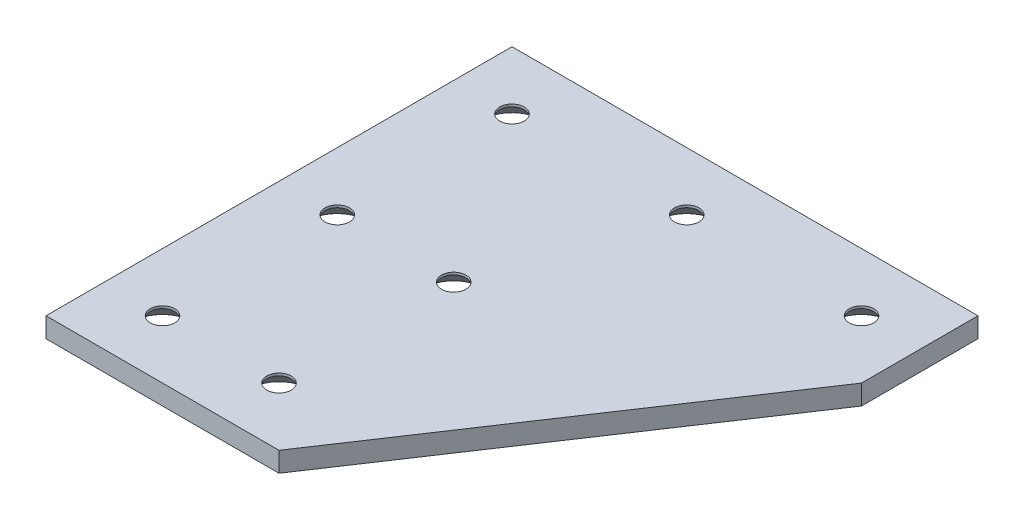
ISO-10303-21;
HEADER;
FILE_DESCRIPTION(('STEP AP214'),'2;1');
FILE_NAME('part.step','',(''),(''),'','','');
FILE_SCHEMA(('AUTOMOTIVE_DESIGN { 1 0 10303 214 1 1 1 1 }'));
ENDSEC;
DATA;
#1=APPLICATION_CONTEXT('core data for automotive mechanical design processes');
#2=APPLICATION_PROTOCOL_DEFINITION('international standard','automotive_design',2000,#1);
#3=PRODUCT_CONTEXT('',#1,'mechanical');
#4=PRODUCT('Part','Part','',(#3));
#5=PRODUCT_RELATED_PRODUCT_CATEGORY('part','',(#4));
#6=PRODUCT_DEFINITION_FORMATION('','',#4);
#7=PRODUCT_DEFINITION_CONTEXT('part definition',#1,'design');
#8=PRODUCT_DEFINITION('design','',#6,#7);
#9=PRODUCT_DEFINITION_SHAPE('','',#8);
#10=(LENGTH_UNIT() NAMED_UNIT(*) SI_UNIT(.MILLI.,.METRE.));
#11=(NAMED_UNIT(*) PLANE_ANGLE_UNIT() SI_UNIT($,.RADIAN.));
#12=(NAMED_UNIT(*) SI_UNIT($,.STERADIAN.) SOLID_ANGLE_UNIT());
#13=UNCERTAINTY_MEASURE_WITH_UNIT(LENGTH_MEASURE(1.E-05),#10,'distance_accuracy_value','');
#14=(GEOMETRIC_REPRESENTATION_CONTEXT(3) GLOBAL_UNCERTAINTY_ASSIGNED_CONTEXT((#13)) GLOBAL_UNIT_ASSIGNED_CONTEXT((#10,
#11,#12)) REPRESENTATION_CONTEXT('',''));
#15=CARTESIAN_POINT('',(0.,0.,0.));
#16=DIRECTION('',(0.,0.,1.));
#17=DIRECTION('',(1.,0.,0.));
#18=AXIS2_PLACEMENT_3D('',#15,#16,#17);
#19=CARTESIAN_POINT('',(0.,3.416,80.));
#20=DIRECTION('',(1.,0.,0.));
#21=DIRECTION('',(0.,0.,1.));
#22=AXIS2_PLACEMENT_3D('',#19,#20,#21);
#23=PLANE('',#22);
#24=DIRECTION('',(0.,0.,-1.));
#25=VECTOR('',#24,1.);
#26=CARTESIAN_POINT('',(0.,0.,80.));
#27=LINE('',#26,#25);
#28=CARTESIAN_POINT('',(0.,0.,80.));
#29=VERTEX_POINT('',#28);
#30=CARTESIAN_POINT('',(0.,0.,0.));
#31=VERTEX_POINT('',#30);
#32=EDGE_CURVE('E118',#29,#31,#27,.T.);
#33=ORIENTED_EDGE('',*,*,#32,.F.);
#34=DIRECTION('',(0.,-1.,0.));
#35=VECTOR('',#34,1.);
#36=CARTESIAN_POINT('',(0.,3.416,80.));
#37=LINE('',#36,#35);
#38=CARTESIAN_POINT('',(0.,3.416,80.));
#39=VERTEX_POINT('',#38);
#40=EDGE_CURVE('E117',#39,#29,#37,.T.);
#41=ORIENTED_EDGE('',*,*,#40,.F.);
#42=DIRECTION('',(0.,0.,-1.));
#43=VECTOR('',#42,1.);
#44=CARTESIAN_POINT('',(0.,3.416,80.));
#45=LINE('',#44,#43);
#46=CARTESIAN_POINT('',(0.,3.416,0.));
#47=VERTEX_POINT('',#46);
#48=EDGE_CURVE('E112',#39,#47,#45,.T.);
#49=ORIENTED_EDGE('',*,*,#48,.T.);
#50=DIRECTION('',(0.,-1.,0.));
#51=VECTOR('',#50,1.);
#52=CARTESIAN_POINT('',(0.,3.416,0.));
#53=LINE('',#52,#51);
#54=EDGE_CURVE('E131',#47,#31,#53,.T.);
#55=ORIENTED_EDGE('',*,*,#54,.T.);
#56=EDGE_LOOP('',(#33,#41,#49,#55));
#57=FACE_BOUND('',#56,.T.);
#58=ADVANCED_FACE('F41',(#57),#23,.F.);
#59=CARTESIAN_POINT('',(0.,3.416,0.));
#60=DIRECTION('',(0.,0.,1.));
#61=DIRECTION('',(-1.,0.,0.));
#62=AXIS2_PLACEMENT_3D('',#59,#60,#61);
#63=PLANE('',#62);
#64=DIRECTION('',(1.,0.,0.));
#65=VECTOR('',#64,1.);
#66=CARTESIAN_POINT('',(0.,0.,0.));
#67=LINE('',#66,#65);
#68=CARTESIAN_POINT('',(80.,0.,0.));
#69=VERTEX_POINT('',#68);
#70=EDGE_CURVE('E120',#31,#69,#67,.T.);
#71=ORIENTED_EDGE('',*,*,#70,.F.);
#72=ORIENTED_EDGE('',*,*,#54,.F.);
#73=DIRECTION('',(1.,0.,0.));
#74=VECTOR('',#73,1.);
#75=CARTESIAN_POINT('',(0.,3.416,0.));
#76=LINE('',#75,#74);
#77=CARTESIAN_POINT('',(80.,3.416,0.));
#78=VERTEX_POINT('',#77);
#79=EDGE_CURVE('E87',#47,#78,#76,.T.);
#80=ORIENTED_EDGE('',*,*,#79,.T.);
#81=DIRECTION('',(0.,-1.,0.));
#82=VECTOR('',#81,1.);
#83=CARTESIAN_POINT('',(80.,3.416,0.));
#84=LINE('',#83,#82);
#85=EDGE_CURVE('E106',#78,#69,#84,.T.);
#86=ORIENTED_EDGE('',*,*,#85,.T.);
#87=EDGE_LOOP('',(#71,#72,#80,#86));
#88=FACE_BOUND('',#87,.T.);
#89=ADVANCED_FACE('F220',(#88),#63,.F.);
#90=CARTESIAN_POINT('',(80.,3.416,0.));
#91=DIRECTION('',(-1.,0.,0.));
#92=DIRECTION('',(0.,0.,-1.));
#93=AXIS2_PLACEMENT_3D('',#90,#91,#92);
#94=PLANE('',#93);
#95=DIRECTION('',(0.,0.,1.));
#96=VECTOR('',#95,1.);
#97=CARTESIAN_POINT('',(80.,0.,0.));
#98=LINE('',#97,#96);
#99=CARTESIAN_POINT('',(80.,0.,20.));
#100=VERTEX_POINT('',#99);
#101=EDGE_CURVE('E124',#69,#100,#98,.T.);
#102=ORIENTED_EDGE('',*,*,#101,.F.);
#103=ORIENTED_EDGE('',*,*,#85,.F.);
#104=DIRECTION('',(0.,0.,1.));
#105=VECTOR('',#104,1.);
#106=CARTESIAN_POINT('',(80.,3.416,0.));
#107=LINE('',#106,#105);
#108=CARTESIAN_POINT('',(80.,3.416,20.));
#109=VERTEX_POINT('',#108);
#110=EDGE_CURVE('E96',#78,#109,#107,.T.);
#111=ORIENTED_EDGE('',*,*,#110,.T.);
#112=DIRECTION('',(0.,-1.,0.));
#113=VECTOR('',#112,1.);
#114=CARTESIAN_POINT('',(80.,3.416,20.));
#115=LINE('',#114,#113);
#116=EDGE_CURVE('E101',#109,#100,#115,.T.);
#117=ORIENTED_EDGE('',*,*,#116,.T.);
#118=EDGE_LOOP('',(#102,#103,#111,#117));
#119=FACE_BOUND('',#118,.T.);
#120=ADVANCED_FACE('F109',(#119),#94,.F.);
#121=CARTESIAN_POINT('',(80.,3.416,20.));
#122=DIRECTION('',(-0.832050294337844,0.,-0.554700196225229));
#123=DIRECTION('',(0.554700196225229,0.,-0.832050294337844));
#124=AXIS2_PLACEMENT_3D('',#121,#122,#123);
#125=PLANE('',#124);
#126=DIRECTION('',(-0.554700196225229,0.,0.832050294337844));
#127=VECTOR('',#126,1.);
#128=CARTESIAN_POINT('',(80.,0.,20.));
#129=LINE('',#128,#127);
#130=CARTESIAN_POINT('',(40.,0.,80.));
#131=VERTEX_POINT('',#130);
#132=EDGE_CURVE('E103',#100,#131,#129,.T.);
#133=ORIENTED_EDGE('',*,*,#132,.F.);
#134=ORIENTED_EDGE('',*,*,#116,.F.);
#135=DIRECTION('',(-0.554700196225229,0.,0.832050294337844));
#136=VECTOR('',#135,1.);
#137=CARTESIAN_POINT('',(80.,3.416,20.));
#138=LINE('',#137,#136);
#139=CARTESIAN_POINT('',(40.,3.416,80.));
#140=VERTEX_POINT('',#139);
#141=EDGE_CURVE('E92',#109,#140,#138,.T.);
#142=ORIENTED_EDGE('',*,*,#141,.T.);
#143=DIRECTION('',(0.,-1.,0.));
#144=VECTOR('',#143,1.);
#145=CARTESIAN_POINT('',(40.,3.416,80.));
#146=LINE('',#145,#144);
#147=EDGE_CURVE('E107',#140,#131,#146,.T.);
#148=ORIENTED_EDGE('',*,*,#147,.T.);
#149=EDGE_LOOP('',(#133,#134,#142,#148));
#150=FACE_BOUND('',#149,.T.);
#151=ADVANCED_FACE('F102',(#150),#125,.F.);
#152=CARTESIAN_POINT('',(40.,3.416,80.));
#153=DIRECTION('',(0.,0.,-1.));
#154=DIRECTION('',(1.,0.,0.));
#155=AXIS2_PLACEMENT_3D('',#152,#153,#154);
#156=PLANE('',#155);
#157=DIRECTION('',(-1.,0.,0.));
#158=VECTOR('',#157,1.);
#159=CARTESIAN_POINT('',(40.,0.,80.));
#160=LINE('',#159,#158);
#161=EDGE_CURVE('E75',#131,#29,#160,.T.);
#162=ORIENTED_EDGE('',*,*,#161,.F.);
#163=ORIENTED_EDGE('',*,*,#147,.F.);
#164=DIRECTION('',(-1.,0.,0.));
#165=VECTOR('',#164,1.);
#166=CARTESIAN_POINT('',(40.,3.416,80.));
#167=LINE('',#166,#165);
#168=EDGE_CURVE('E58',#140,#39,#167,.T.);
#169=ORIENTED_EDGE('',*,*,#168,.T.);
#170=ORIENTED_EDGE('',*,*,#40,.T.);
#171=EDGE_LOOP('',(#162,#163,#169,#170));
#172=FACE_BOUND('',#171,.T.);
#173=ADVANCED_FACE('F207',(#172),#156,.F.);
#174=CARTESIAN_POINT('',(0.,3.416,0.));
#175=DIRECTION('',(0.,1.,0.));
#176=DIRECTION('',(0.,0.,-1.));
#177=AXIS2_PLACEMENT_3D('',#174,#175,#176);
#178=PLANE('',#177);
#179=CARTESIAN_POINT('',(9.99999999999979,3.416,70.));
#180=DIRECTION('',(0.,-1.,0.));
#181=DIRECTION('',(0.,0.,-1.));
#182=AXIS2_PLACEMENT_3D('',#179,#180,#181);
#183=CIRCLE('',#182,2.1);
#184=CARTESIAN_POINT('',(9.99999999999979,3.416,67.9));
#185=VERTEX_POINT('',#184);
#186=EDGE_CURVE('E201',#185,#185,#183,.T.);
#187=ORIENTED_EDGE('',*,*,#186,.T.);
#188=EDGE_LOOP('',(#187));
#189=FACE_BOUND('',#188,.T.);
#190=CARTESIAN_POINT('',(9.9999999999999,3.416,40.));
#191=DIRECTION('',(0.,-1.,0.));
#192=DIRECTION('',(0.,0.,-1.));
#193=AXIS2_PLACEMENT_3D('',#190,#191,#192);
#194=CIRCLE('',#193,2.1);
#195=CARTESIAN_POINT('',(9.9999999999999,3.416,37.9));
#196=VERTEX_POINT('',#195);
#197=EDGE_CURVE('E198',#196,#196,#194,.T.);
#198=ORIENTED_EDGE('',*,*,#197,.T.);
#199=EDGE_LOOP('',(#198));
#200=FACE_BOUND('',#199,.T.);
#201=CARTESIAN_POINT('',(29.9999999999998,3.416,70.));
#202=DIRECTION('',(0.,-1.,0.));
#203=DIRECTION('',(0.,0.,-1.));
#204=AXIS2_PLACEMENT_3D('',#201,#202,#203);
#205=CIRCLE('',#204,2.1);
#206=CARTESIAN_POINT('',(29.9999999999998,3.416,67.9));
#207=VERTEX_POINT('',#206);
#208=EDGE_CURVE('E195',#207,#207,#205,.T.);
#209=ORIENTED_EDGE('',*,*,#208,.T.);
#210=EDGE_LOOP('',(#209));
#211=FACE_BOUND('',#210,.T.);
#212=CARTESIAN_POINT('',(29.9999999999999,3.416,40.));
#213=DIRECTION('',(0.,-1.,0.));
#214=DIRECTION('',(0.,0.,-1.));
#215=AXIS2_PLACEMENT_3D('',#212,#213,#214);
#216=CIRCLE('',#215,2.1);
#217=CARTESIAN_POINT('',(29.9999999999999,3.416,37.9));
#218=VERTEX_POINT('',#217);
#219=EDGE_CURVE('E190',#218,#218,#216,.T.);
#220=ORIENTED_EDGE('',*,*,#219,.T.);
#221=EDGE_LOOP('',(#220));
#222=FACE_BOUND('',#221,.T.);
#223=CARTESIAN_POINT('',(70.,3.416,9.99999999999999));
#224=DIRECTION('',(0.,-1.,0.));
#225=DIRECTION('',(0.,0.,-1.));
#226=AXIS2_PLACEMENT_3D('',#223,#224,#225);
#227=CIRCLE('',#226,2.1);
#228=CARTESIAN_POINT('',(70.,3.416,7.89999999999999));
#229=VERTEX_POINT('',#228);
#230=EDGE_CURVE('E185',#229,#229,#227,.T.);
#231=ORIENTED_EDGE('',*,*,#230,.T.);
#232=EDGE_LOOP('',(#231));
#233=FACE_BOUND('',#232,.T.);
#234=CARTESIAN_POINT('',(40.,3.416,9.99999999999999));
#235=DIRECTION('',(0.,-1.,0.));
#236=DIRECTION('',(0.,0.,-1.));
#237=AXIS2_PLACEMENT_3D('',#234,#235,#236);
#238=CIRCLE('',#237,2.1);
#239=CARTESIAN_POINT('',(40.,3.416,7.9));
#240=VERTEX_POINT('',#239);
#241=EDGE_CURVE('E183',#240,#240,#238,.T.);
#242=ORIENTED_EDGE('',*,*,#241,.T.);
#243=EDGE_LOOP('',(#242));
#244=FACE_BOUND('',#243,.T.);
#245=CARTESIAN_POINT('',(10.,3.416,9.99999999999999));
#246=DIRECTION('',(0.,-1.,0.));
#247=DIRECTION('',(0.,0.,-1.));
#248=AXIS2_PLACEMENT_3D('',#245,#246,#247);
#249=CIRCLE('',#248,2.1);
#250=CARTESIAN_POINT('',(10.,3.416,7.89999999999999));
#251=VERTEX_POINT('',#250);
#252=EDGE_CURVE('E121',#251,#251,#249,.T.);
#253=ORIENTED_EDGE('',*,*,#252,.T.);
#254=EDGE_LOOP('',(#253));
#255=FACE_BOUND('',#254,.T.);
#256=ORIENTED_EDGE('',*,*,#48,.F.);
#257=ORIENTED_EDGE('',*,*,#168,.F.);
#258=ORIENTED_EDGE('',*,*,#141,.F.);
#259=ORIENTED_EDGE('',*,*,#110,.F.);
#260=ORIENTED_EDGE('',*,*,#79,.F.);
#261=EDGE_LOOP('',(#256,#257,#258,#259,#260));
#262=FACE_BOUND('',#261,.T.);
#263=ADVANCED_FACE('F94',(#189,#200,#211,#222,#233,#244,#255,#262),#178,.T.);
#264=CARTESIAN_POINT('',(0.,0.,0.));
#265=DIRECTION('',(0.,1.,0.));
#266=DIRECTION('',(0.,0.,-1.));
#267=AXIS2_PLACEMENT_3D('',#264,#265,#266);
#268=PLANE('',#267);
#269=CARTESIAN_POINT('',(9.99999999999979,0.,70.));
#270=DIRECTION('',(0.,-1.,0.));
#271=DIRECTION('',(0.,0.,-1.));
#272=AXIS2_PLACEMENT_3D('',#269,#270,#271);
#273=CIRCLE('',#272,5.10000000000001);
#274=CARTESIAN_POINT('',(9.99999999999979,0.,64.9));
#275=VERTEX_POINT('',#274);
#276=EDGE_CURVE('E152',#275,#275,#273,.T.);
#277=ORIENTED_EDGE('',*,*,#276,.F.);
#278=EDGE_LOOP('',(#277));
#279=FACE_BOUND('',#278,.T.);
#280=CARTESIAN_POINT('',(29.9999999999998,0.,70.));
#281=DIRECTION('',(0.,-1.,0.));
#282=DIRECTION('',(0.,0.,-1.));
#283=AXIS2_PLACEMENT_3D('',#280,#281,#282);
#284=CIRCLE('',#283,5.10000000000001);
#285=CARTESIAN_POINT('',(29.9999999999998,0.,64.9));
#286=VERTEX_POINT('',#285);
#287=EDGE_CURVE('E149',#286,#286,#284,.T.);
#288=ORIENTED_EDGE('',*,*,#287,.F.);
#289=EDGE_LOOP('',(#288));
#290=FACE_BOUND('',#289,.T.);
#291=CARTESIAN_POINT('',(29.9999999999999,0.,40.));
#292=DIRECTION('',(0.,-1.,0.));
#293=DIRECTION('',(0.,0.,-1.));
#294=AXIS2_PLACEMENT_3D('',#291,#292,#293);
#295=CIRCLE('',#294,5.10000000000001);
#296=CARTESIAN_POINT('',(29.9999999999999,0.,45.1));
#297=VERTEX_POINT('',#296);
#298=EDGE_CURVE('E146',#297,#297,#295,.T.);
#299=ORIENTED_EDGE('',*,*,#298,.F.);
#300=EDGE_LOOP('',(#299));
#301=FACE_BOUND('',#300,.T.);
#302=CARTESIAN_POINT('',(9.9999999999999,0.,40.));
#303=DIRECTION('',(0.,-1.,0.));
#304=DIRECTION('',(0.,0.,-1.));
#305=AXIS2_PLACEMENT_3D('',#302,#303,#304);
#306=CIRCLE('',#305,5.10000000000001);
#307=CARTESIAN_POINT('',(9.9999999999999,0.,34.9));
#308=VERTEX_POINT('',#307);
#309=EDGE_CURVE('E143',#308,#308,#306,.T.);
#310=ORIENTED_EDGE('',*,*,#309,.F.);
#311=EDGE_LOOP('',(#310));
#312=FACE_BOUND('',#311,.T.);
#313=CARTESIAN_POINT('',(10.,0.,9.99999999999999));
#314=DIRECTION('',(0.,-1.,0.));
#315=DIRECTION('',(0.,0.,-1.));
#316=AXIS2_PLACEMENT_3D('',#313,#314,#315);
#317=CIRCLE('',#316,5.10000000000001);
#318=CARTESIAN_POINT('',(10.,0.,4.89999999999999));
#319=VERTEX_POINT('',#318);
#320=EDGE_CURVE('E140',#319,#319,#317,.T.);
#321=ORIENTED_EDGE('',*,*,#320,.F.);
#322=EDGE_LOOP('',(#321));
#323=FACE_BOUND('',#322,.T.);
#324=CARTESIAN_POINT('',(40.,0.,9.99999999999999));
#325=DIRECTION('',(0.,-1.,0.));
#326=DIRECTION('',(0.,0.,-1.));
#327=AXIS2_PLACEMENT_3D('',#324,#325,#326);
#328=CIRCLE('',#327,5.10000000000001);
#329=CARTESIAN_POINT('',(40.,0.,4.89999999999999));
#330=VERTEX_POINT('',#329);
#331=EDGE_CURVE('E137',#330,#330,#328,.T.);
#332=ORIENTED_EDGE('',*,*,#331,.F.);
#333=EDGE_LOOP('',(#332));
#334=FACE_BOUND('',#333,.T.);
#335=CARTESIAN_POINT('',(70.,0.,9.99999999999999));
#336=DIRECTION('',(0.,-1.,0.));
#337=DIRECTION('',(0.,0.,-1.));
#338=AXIS2_PLACEMENT_3D('',#335,#336,#337);
#339=CIRCLE('',#338,5.10000000000001);
#340=CARTESIAN_POINT('',(70.,0.,4.89999999999999));
#341=VERTEX_POINT('',#340);
#342=EDGE_CURVE('E134',#341,#341,#339,.T.);
#343=ORIENTED_EDGE('',*,*,#342,.F.);
#344=EDGE_LOOP('',(#343));
#345=FACE_BOUND('',#344,.T.);
#346=ORIENTED_EDGE('',*,*,#32,.T.);
#347=ORIENTED_EDGE('',*,*,#70,.T.);
#348=ORIENTED_EDGE('',*,*,#101,.T.);
#349=ORIENTED_EDGE('',*,*,#132,.T.);
#350=ORIENTED_EDGE('',*,*,#161,.T.);
#351=EDGE_LOOP('',(#346,#347,#348,#349,#350));
#352=FACE_BOUND('',#351,.T.);
#353=ADVANCED_FACE('F214',(#279,#290,#301,#312,#323,#334,#345,#352),#268,.F.);
#354=CARTESIAN_POINT('',(10.,-0.584,9.99999999999999));
#355=DIRECTION('',(0.,1.,0.));
#356=DIRECTION('',(0.,0.,-1.));
#357=AXIS2_PLACEMENT_3D('',#354,#355,#356);
#358=CYLINDRICAL_SURFACE('',#357,2.1);
#359=CARTESIAN_POINT('',(10.,3.00000000000001,9.99999999999999));
#360=DIRECTION('',(0.,-1.,0.));
#361=DIRECTION('',(0.,0.,-1.));
#362=AXIS2_PLACEMENT_3D('',#359,#360,#361);
#363=CIRCLE('',#362,2.1);
#364=CARTESIAN_POINT('',(10.,3.00000000000001,7.89999999999999));
#365=VERTEX_POINT('',#364);
#366=EDGE_CURVE('E167',#365,#365,#363,.F.);
#367=ORIENTED_EDGE('',*,*,#366,.F.);
#368=EDGE_LOOP('',(#367));
#369=FACE_BOUND('',#368,.T.);
#370=ORIENTED_EDGE('',*,*,#252,.F.);
#371=EDGE_LOOP('',(#370));
#372=FACE_BOUND('',#371,.T.);
#373=ADVANCED_FACE('F179',(#369,#372),#358,.F.);
#374=CARTESIAN_POINT('',(40.,-0.584,9.99999999999999));
#375=DIRECTION('',(0.,1.,0.));
#376=DIRECTION('',(0.,0.,-1.));
#377=AXIS2_PLACEMENT_3D('',#374,#375,#376);
#378=CYLINDRICAL_SURFACE('',#377,2.1);
#379=CARTESIAN_POINT('',(40.,3.00000000000002,9.99999999999999));
#380=DIRECTION('',(0.,-1.,0.));
#381=DIRECTION('',(0.,0.,-1.));
#382=AXIS2_PLACEMENT_3D('',#379,#380,#381);
#383=CIRCLE('',#382,2.1);
#384=CARTESIAN_POINT('',(40.,3.00000000000002,7.9));
#385=VERTEX_POINT('',#384);
#386=EDGE_CURVE('E50',#385,#385,#383,.F.);
#387=ORIENTED_EDGE('',*,*,#386,.F.);
#388=EDGE_LOOP('',(#387));
#389=FACE_BOUND('',#388,.T.);
#390=ORIENTED_EDGE('',*,*,#241,.F.);
#391=EDGE_LOOP('',(#390));
#392=FACE_BOUND('',#391,.T.);
#393=ADVANCED_FACE('F175',(#389,#392),#378,.F.);
#394=CARTESIAN_POINT('',(70.,-0.584,9.99999999999999));
#395=DIRECTION('',(0.,1.,0.));
#396=DIRECTION('',(0.,0.,-1.));
#397=AXIS2_PLACEMENT_3D('',#394,#395,#396);
#398=CYLINDRICAL_SURFACE('',#397,2.1);
#399=CARTESIAN_POINT('',(70.,3.00000000000001,9.99999999999999));
#400=DIRECTION('',(0.,-1.,0.));
#401=DIRECTION('',(0.,0.,-1.));
#402=AXIS2_PLACEMENT_3D('',#399,#400,#401);
#403=CIRCLE('',#402,2.1);
#404=CARTESIAN_POINT('',(70.,3.00000000000001,7.89999999999999));
#405=VERTEX_POINT('',#404);
#406=EDGE_CURVE('E11',#405,#405,#403,.F.);
#407=ORIENTED_EDGE('',*,*,#406,.F.);
#408=EDGE_LOOP('',(#407));
#409=FACE_BOUND('',#408,.T.);
#410=ORIENTED_EDGE('',*,*,#230,.F.);
#411=EDGE_LOOP('',(#410));
#412=FACE_BOUND('',#411,.T.);
#413=ADVANCED_FACE('F178',(#409,#412),#398,.F.);
#414=CARTESIAN_POINT('',(29.9999999999999,-0.584,40.));
#415=DIRECTION('',(0.,1.,0.));
#416=DIRECTION('',(0.,0.,-1.));
#417=AXIS2_PLACEMENT_3D('',#414,#415,#416);
#418=CYLINDRICAL_SURFACE('',#417,2.1);
#419=CARTESIAN_POINT('',(29.9999999999999,3.00000000000003,40.));
#420=DIRECTION('',(0.,-1.,0.));
#421=DIRECTION('',(0.,0.,-1.));
#422=AXIS2_PLACEMENT_3D('',#419,#420,#421);
#423=CIRCLE('',#422,2.1);
#424=CARTESIAN_POINT('',(29.9999999999999,3.00000000000003,42.1));
#425=VERTEX_POINT('',#424);
#426=EDGE_CURVE('E161',#425,#425,#423,.F.);
#427=ORIENTED_EDGE('',*,*,#426,.F.);
#428=EDGE_LOOP('',(#427));
#429=FACE_BOUND('',#428,.T.);
#430=ORIENTED_EDGE('',*,*,#219,.F.);
#431=EDGE_LOOP('',(#430));
#432=FACE_BOUND('',#431,.T.);
#433=ADVANCED_FACE('F280',(#429,#432),#418,.F.);
#434=CARTESIAN_POINT('',(29.9999999999998,-0.584,70.));
#435=DIRECTION('',(0.,1.,0.));
#436=DIRECTION('',(0.,0.,-1.));
#437=AXIS2_PLACEMENT_3D('',#434,#435,#436);
#438=CYLINDRICAL_SURFACE('',#437,2.1);
#439=CARTESIAN_POINT('',(29.9999999999998,3.00000000000002,70.));
#440=DIRECTION('',(0.,-1.,0.));
#441=DIRECTION('',(0.,0.,-1.));
#442=AXIS2_PLACEMENT_3D('',#439,#440,#441);
#443=CIRCLE('',#442,2.1);
#444=CARTESIAN_POINT('',(29.9999999999998,3.00000000000002,67.9));
#445=VERTEX_POINT('',#444);
#446=EDGE_CURVE('E158',#445,#445,#443,.F.);
#447=ORIENTED_EDGE('',*,*,#446,.F.);
#448=EDGE_LOOP('',(#447));
#449=FACE_BOUND('',#448,.T.);
#450=ORIENTED_EDGE('',*,*,#208,.F.);
#451=EDGE_LOOP('',(#450));
#452=FACE_BOUND('',#451,.T.);
#453=ADVANCED_FACE('F276',(#449,#452),#438,.F.);
#454=CARTESIAN_POINT('',(9.9999999999999,-0.584,40.));
#455=DIRECTION('',(0.,1.,0.));
#456=DIRECTION('',(0.,0.,-1.));
#457=AXIS2_PLACEMENT_3D('',#454,#455,#456);
#458=CYLINDRICAL_SURFACE('',#457,2.1);
#459=CARTESIAN_POINT('',(9.9999999999999,3.00000000000003,40.));
#460=DIRECTION('',(0.,-1.,0.));
#461=DIRECTION('',(0.,0.,-1.));
#462=AXIS2_PLACEMENT_3D('',#459,#460,#461);
#463=CIRCLE('',#462,2.1);
#464=CARTESIAN_POINT('',(9.9999999999999,3.00000000000003,37.9));
#465=VERTEX_POINT('',#464);
#466=EDGE_CURVE('E164',#465,#465,#463,.F.);
#467=ORIENTED_EDGE('',*,*,#466,.F.);
#468=EDGE_LOOP('',(#467));
#469=FACE_BOUND('',#468,.T.);
#470=ORIENTED_EDGE('',*,*,#197,.F.);
#471=EDGE_LOOP('',(#470));
#472=FACE_BOUND('',#471,.T.);
#473=ADVANCED_FACE('F272',(#469,#472),#458,.F.);
#474=CARTESIAN_POINT('',(9.99999999999979,-0.584,70.));
#475=DIRECTION('',(0.,1.,0.));
#476=DIRECTION('',(0.,0.,-1.));
#477=AXIS2_PLACEMENT_3D('',#474,#475,#476);
#478=CYLINDRICAL_SURFACE('',#477,2.1);
#479=CARTESIAN_POINT('',(9.99999999999979,3.00000000000003,70.));
#480=DIRECTION('',(0.,-1.,0.));
#481=DIRECTION('',(0.,0.,-1.));
#482=AXIS2_PLACEMENT_3D('',#479,#480,#481);
#483=CIRCLE('',#482,2.1);
#484=CARTESIAN_POINT('',(9.99999999999979,3.00000000000003,67.9));
#485=VERTEX_POINT('',#484);
#486=EDGE_CURVE('E155',#485,#485,#483,.F.);
#487=ORIENTED_EDGE('',*,*,#486,.F.);
#488=EDGE_LOOP('',(#487));
#489=FACE_BOUND('',#488,.T.);
#490=ORIENTED_EDGE('',*,*,#186,.F.);
#491=EDGE_LOOP('',(#490));
#492=FACE_BOUND('',#491,.T.);
#493=ADVANCED_FACE('F233',(#489,#492),#478,.F.);
#494=CARTESIAN_POINT('',(9.99999999999979,0.,70.));
#495=DIRECTION('',(0.,-1.,0.));
#496=DIRECTION('',(0.,0.,1.));
#497=AXIS2_PLACEMENT_3D('',#494,#495,#496);
#498=CONICAL_SURFACE('',#497,5.10000000000001,0.785398163397443);
#499=ORIENTED_EDGE('',*,*,#486,.T.);
#500=EDGE_LOOP('',(#499));
#501=FACE_BOUND('',#500,.T.);
#502=ORIENTED_EDGE('',*,*,#276,.T.);
#503=EDGE_LOOP('',(#502));
#504=FACE_BOUND('',#503,.T.);
#505=ADVANCED_FACE('F229',(#501,#504),#498,.F.);
#506=CARTESIAN_POINT('',(29.9999999999998,0.,70.));
#507=DIRECTION('',(0.,-1.,0.));
#508=DIRECTION('',(0.,0.,1.));
#509=AXIS2_PLACEMENT_3D('',#506,#507,#508);
#510=CONICAL_SURFACE('',#509,5.10000000000001,0.785398163397446);
#511=ORIENTED_EDGE('',*,*,#446,.T.);
#512=EDGE_LOOP('',(#511));
#513=FACE_BOUND('',#512,.T.);
#514=ORIENTED_EDGE('',*,*,#287,.T.);
#515=EDGE_LOOP('',(#514));
#516=FACE_BOUND('',#515,.T.);
#517=ADVANCED_FACE('F232',(#513,#516),#510,.F.);
#518=CARTESIAN_POINT('',(29.9999999999999,0.,40.));
#519=DIRECTION('',(0.,-1.,0.));
#520=DIRECTION('',(0.,0.,1.));
#521=AXIS2_PLACEMENT_3D('',#518,#519,#520);
#522=CONICAL_SURFACE('',#521,5.10000000000001,0.785398163397443);
#523=CARTESIAN_POINT('',(29.9999999999999,3.00000000000003,42.1));
#524=CARTESIAN_POINT('',(29.9999999999999,2.96875000000003,42.13125));
#525=CARTESIAN_POINT('',(29.9999999999999,2.93750000000003,42.1625));
#526=CARTESIAN_POINT('',(29.9999999999999,2.87500000000003,42.225));
#527=CARTESIAN_POINT('',(29.9999999999999,2.84375000000003,42.25625));
#528=CARTESIAN_POINT('',(29.9999999999999,2.78125000000003,42.31875));
#529=CARTESIAN_POINT('',(29.9999999999999,2.75000000000003,42.35));
#530=CARTESIAN_POINT('',(29.9999999999999,2.68750000000003,42.4125));
#531=CARTESIAN_POINT('',(29.9999999999999,2.65625000000003,42.44375));
#532=CARTESIAN_POINT('',(29.9999999999999,2.59375000000003,42.50625));
#533=CARTESIAN_POINT('',(29.9999999999999,2.56250000000003,42.5375));
#534=CARTESIAN_POINT('',(29.9999999999999,2.50000000000003,42.6));
#535=CARTESIAN_POINT('',(29.9999999999999,2.46875000000003,42.63125));
#536=CARTESIAN_POINT('',(29.9999999999999,2.40625000000003,42.69375));
#537=CARTESIAN_POINT('',(29.9999999999999,2.37500000000003,42.725));
#538=CARTESIAN_POINT('',(29.9999999999999,2.31250000000002,42.7875));
#539=CARTESIAN_POINT('',(29.9999999999999,2.28125000000003,42.81875));
#540=CARTESIAN_POINT('',(29.9999999999999,2.21875000000003,42.88125));
#541=CARTESIAN_POINT('',(29.9999999999999,2.18750000000002,42.9125));
#542=CARTESIAN_POINT('',(29.9999999999999,2.12500000000002,42.975));
#543=CARTESIAN_POINT('',(29.9999999999999,2.09375000000002,43.00625));
#544=CARTESIAN_POINT('',(29.9999999999999,2.03125000000002,43.06875));
#545=CARTESIAN_POINT('',(29.9999999999999,2.00000000000002,43.1));
#546=CARTESIAN_POINT('',(29.9999999999999,1.93750000000002,43.1625));
#547=CARTESIAN_POINT('',(29.9999999999999,1.90625000000002,43.19375));
#548=CARTESIAN_POINT('',(29.9999999999999,1.84375000000002,43.25625));
#549=CARTESIAN_POINT('',(29.9999999999999,1.81250000000002,43.2875));
#550=CARTESIAN_POINT('',(29.9999999999999,1.75000000000002,43.35));
#551=CARTESIAN_POINT('',(29.9999999999999,1.71875000000002,43.38125));
#552=CARTESIAN_POINT('',(29.9999999999999,1.65625000000002,43.44375));
#553=CARTESIAN_POINT('',(29.9999999999999,1.62500000000002,43.475));
#554=CARTESIAN_POINT('',(29.9999999999999,1.56250000000002,43.5375));
#555=CARTESIAN_POINT('',(29.9999999999999,1.53125000000002,43.56875));
#556=CARTESIAN_POINT('',(29.9999999999999,1.46875000000002,43.63125));
#557=CARTESIAN_POINT('',(29.9999999999999,1.43750000000002,43.6625));
#558=CARTESIAN_POINT('',(29.9999999999999,1.37500000000001,43.725));
#559=CARTESIAN_POINT('',(29.9999999999999,1.34375000000002,43.75625));
#560=CARTESIAN_POINT('',(29.9999999999999,1.28125000000001,43.81875));
#561=CARTESIAN_POINT('',(29.9999999999999,1.25000000000001,43.85));
#562=CARTESIAN_POINT('',(29.9999999999999,1.18750000000001,43.9125));
#563=CARTESIAN_POINT('',(29.9999999999999,1.15625000000001,43.94375));
#564=CARTESIAN_POINT('',(29.9999999999999,1.09375000000001,44.00625));
#565=CARTESIAN_POINT('',(29.9999999999999,1.06250000000001,44.0375));
#566=CARTESIAN_POINT('',(29.9999999999999,1.00000000000001,44.1));
#567=CARTESIAN_POINT('',(29.9999999999999,0.968750000000011,44.13125));
#568=CARTESIAN_POINT('',(29.9999999999999,0.90625000000001,44.19375));
#569=CARTESIAN_POINT('',(29.9999999999999,0.875000000000009,44.225));
#570=CARTESIAN_POINT('',(29.9999999999999,0.812500000000008,44.2875));
#571=CARTESIAN_POINT('',(29.9999999999999,0.781250000000008,44.31875));
#572=CARTESIAN_POINT('',(29.9999999999999,0.718750000000008,44.38125));
#573=CARTESIAN_POINT('',(29.9999999999999,0.687500000000008,44.4125));
#574=CARTESIAN_POINT('',(29.9999999999999,0.625000000000008,44.475));
#575=CARTESIAN_POINT('',(29.9999999999999,0.593750000000007,44.50625));
#576=CARTESIAN_POINT('',(29.9999999999999,0.531250000000006,44.56875));
#577=CARTESIAN_POINT('',(29.9999999999999,0.500000000000005,44.6));
#578=CARTESIAN_POINT('',(29.9999999999999,0.437500000000004,44.6625));
#579=CARTESIAN_POINT('',(29.9999999999999,0.406250000000004,44.69375));
#580=CARTESIAN_POINT('',(29.9999999999999,0.343750000000004,44.75625));
#581=CARTESIAN_POINT('',(29.9999999999999,0.312500000000004,44.7875));
#582=CARTESIAN_POINT('',(29.9999999999999,0.250000000000003,44.85));
#583=CARTESIAN_POINT('',(29.9999999999999,0.218750000000003,44.88125));
#584=CARTESIAN_POINT('',(29.9999999999999,0.156250000000001,44.94375));
#585=CARTESIAN_POINT('',(29.9999999999999,0.125000000000001,44.975));
#586=CARTESIAN_POINT('',(29.9999999999999,0.0624999999999999,45.0375));
#587=CARTESIAN_POINT('',(29.9999999999999,0.0312499999999994,45.06875));
#588=CARTESIAN_POINT('',(29.9999999999999,0.,45.1));
#589=B_SPLINE_CURVE_WITH_KNOTS('',3,(#523,#524,#525,#526,#527,#528,#529,#530,#531,#532,#533,
#534,#535,#536,#537,#538,#539,#540,#541,#542,#543,#544,#545,#546,#547,#548,#549,#550,#551,#552,
#553,#554,#555,#556,#557,#558,#559,#560,#561,#562,#563,#564,#565,#566,#567,#568,#569,#570,#571,
#572,#573,#574,#575,#576,#577,#578,#579,#580,#581,#582,#583,#584,#585,#586,#587,#588),
.UNSPECIFIED.,.F.,.F.,(4,2,2,2,2,2,2,2,2,2,2,2,2,2,2,2,2,2,2,2,2,2,2,2,2,2,2,2,2,2,2,2,4),(0.,
0.132582521472476,0.265165042944957,0.397747564417433,0.530330085889914,0.66291260736239,
0.795495128834871,0.928077650307347,1.06066017177983,1.1932426932523,1.32582521472478,
1.45840773619726,1.59099025766974,1.72357277914222,1.8561553006147,1.98873782208717,
2.12132034355965,2.25390286503213,2.38648538650461,2.51906790797709,2.65165042944957,
2.78423295092205,2.91681547239453,3.049397993867,3.18198051533948,3.31456303681196,
3.44714555828444,3.57972807975692,3.7123106012294,3.84489312270188,3.97747564417435,
4.11005816564683,4.24264068711931),.UNSPECIFIED.);
#590=EDGE_CURVE('BSEAM237',#425,#297,#589,.T.);
#591=ORIENTED_EDGE('',*,*,#426,.T.);
#592=ORIENTED_EDGE('',*,*,#298,.T.);
#593=ORIENTED_EDGE('',*,*,#590,.T.);
#594=ORIENTED_EDGE('',*,*,#590,.F.);
#595=EDGE_LOOP('',(#591,#593,#592,#594));
#596=FACE_BOUND('',#595,.T.);
#597=ADVANCED_FACE('F237',(#596),#522,.F.);
#598=CARTESIAN_POINT('',(9.9999999999999,0.,40.));
#599=DIRECTION('',(0.,-1.,0.));
#600=DIRECTION('',(0.,0.,1.));
#601=AXIS2_PLACEMENT_3D('',#598,#599,#600);
#602=CONICAL_SURFACE('',#601,5.10000000000001,0.785398163397443);
#603=ORIENTED_EDGE('',*,*,#466,.T.);
#604=EDGE_LOOP('',(#603));
#605=FACE_BOUND('',#604,.T.);
#606=ORIENTED_EDGE('',*,*,#309,.T.);
#607=EDGE_LOOP('',(#606));
#608=FACE_BOUND('',#607,.T.);
#609=ADVANCED_FACE('F241',(#605,#608),#602,.F.);
#610=CARTESIAN_POINT('',(10.,0.,9.99999999999999));
#611=DIRECTION('',(0.,-1.,0.));
#612=DIRECTION('',(0.,0.,1.));
#613=AXIS2_PLACEMENT_3D('',#610,#611,#612);
#614=CONICAL_SURFACE('',#613,5.10000000000001,0.785398163397447);
#615=ORIENTED_EDGE('',*,*,#366,.T.);
#616=EDGE_LOOP('',(#615));
#617=FACE_BOUND('',#616,.T.);
#618=ORIENTED_EDGE('',*,*,#320,.T.);
#619=EDGE_LOOP('',(#618));
#620=FACE_BOUND('',#619,.T.);
#621=ADVANCED_FACE('F245',(#617,#620),#614,.F.);
#622=CARTESIAN_POINT('',(40.,0.,9.99999999999999));
#623=DIRECTION('',(0.,-1.,0.));
#624=DIRECTION('',(0.,0.,1.));
#625=AXIS2_PLACEMENT_3D('',#622,#623,#624);
#626=CONICAL_SURFACE('',#625,5.10000000000001,0.785398163397447);
#627=ORIENTED_EDGE('',*,*,#386,.T.);
#628=EDGE_LOOP('',(#627));
#629=FACE_BOUND('',#628,.T.);
#630=ORIENTED_EDGE('',*,*,#331,.T.);
#631=EDGE_LOOP('',(#630));
#632=FACE_BOUND('',#631,.T.);
#633=ADVANCED_FACE('F172',(#629,#632),#626,.F.);
#634=CARTESIAN_POINT('',(70.,0.,9.99999999999999));
#635=DIRECTION('',(0.,-1.,0.));
#636=DIRECTION('',(0.,0.,1.));
#637=AXIS2_PLACEMENT_3D('',#634,#635,#636);
#638=CONICAL_SURFACE('',#637,5.10000000000001,0.785398163397447);
#639=ORIENTED_EDGE('',*,*,#406,.T.);
#640=EDGE_LOOP('',(#639));
#641=FACE_BOUND('',#640,.T.);
#642=ORIENTED_EDGE('',*,*,#342,.T.);
#643=EDGE_LOOP('',(#642));
#644=FACE_BOUND('',#643,.T.);
#645=ADVANCED_FACE('F43',(#641,#644),#638,.F.);
#646=CLOSED_SHELL('',(#58,#89,#120,#151,#173,#263,#353,#373,#393,#413,#433,#453,#473,#493,#505,
#517,#597,#609,#621,#633,#645));
#647=MANIFOLD_SOLID_BREP('B2',#646);
#648=ADVANCED_BREP_SHAPE_REPRESENTATION('',(#18,#647),#14);
#649=SHAPE_DEFINITION_REPRESENTATION(#9,#648);
ENDSEC;
END-ISO-10303-21;
